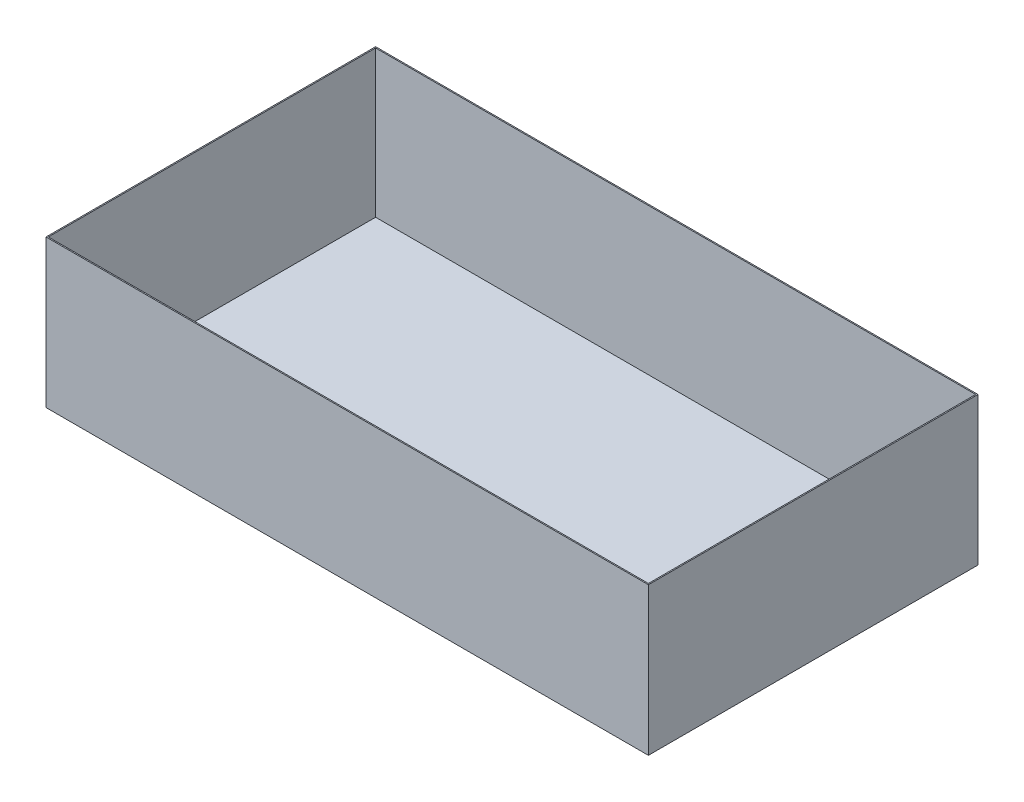
ISO-10303-21;
HEADER;
FILE_DESCRIPTION(('STEP AP214'),'2;1');
FILE_NAME('part.step','',(''),(''),'','','');
FILE_SCHEMA(('AUTOMOTIVE_DESIGN { 1 0 10303 214 1 1 1 1 }'));
ENDSEC;
DATA;
#1=APPLICATION_CONTEXT('core data for automotive mechanical design processes');
#2=APPLICATION_PROTOCOL_DEFINITION('international standard','automotive_design',2000,#1);
#3=PRODUCT_CONTEXT('',#1,'mechanical');
#4=PRODUCT('Part','Part','',(#3));
#5=PRODUCT_RELATED_PRODUCT_CATEGORY('part','',(#4));
#6=PRODUCT_DEFINITION_FORMATION('','',#4);
#7=PRODUCT_DEFINITION_CONTEXT('part definition',#1,'design');
#8=PRODUCT_DEFINITION('design','',#6,#7);
#9=PRODUCT_DEFINITION_SHAPE('','',#8);
#10=(LENGTH_UNIT() NAMED_UNIT(*) SI_UNIT(.MILLI.,.METRE.));
#11=(NAMED_UNIT(*) PLANE_ANGLE_UNIT() SI_UNIT($,.RADIAN.));
#12=(NAMED_UNIT(*) SI_UNIT($,.STERADIAN.) SOLID_ANGLE_UNIT());
#13=UNCERTAINTY_MEASURE_WITH_UNIT(LENGTH_MEASURE(1.E-05),#10,'distance_accuracy_value','');
#14=(GEOMETRIC_REPRESENTATION_CONTEXT(3) GLOBAL_UNCERTAINTY_ASSIGNED_CONTEXT((#13)) GLOBAL_UNIT_ASSIGNED_CONTEXT((#10,
#11,#12)) REPRESENTATION_CONTEXT('',''));
#15=CARTESIAN_POINT('',(0.,0.,0.));
#16=DIRECTION('',(0.,0.,1.));
#17=DIRECTION('',(1.,0.,0.));
#18=AXIS2_PLACEMENT_3D('',#15,#16,#17);
#19=CARTESIAN_POINT('',(-224.976152623211,130.,-90.5802861685215));
#20=DIRECTION('',(1.,0.,0.));
#21=DIRECTION('',(0.,0.,-1.));
#22=AXIS2_PLACEMENT_3D('',#19,#20,#21);
#23=PLANE('',#22);
#24=DIRECTION('',(0.,0.,1.));
#25=VECTOR('',#24,1.);
#26=CARTESIAN_POINT('',(-224.976152623211,0.,-90.5802861685215));
#27=LINE('',#26,#25);
#28=CARTESIAN_POINT('',(-224.976152623211,0.,-90.5802861685215));
#29=VERTEX_POINT('',#28);
#30=CARTESIAN_POINT('',(-224.976152623211,0.,199.419713831479));
#31=VERTEX_POINT('',#30);
#32=EDGE_CURVE('E167',#29,#31,#27,.T.);
#33=ORIENTED_EDGE('',*,*,#32,.T.);
#34=DIRECTION('',(0.,-1.,0.));
#35=VECTOR('',#34,1.);
#36=CARTESIAN_POINT('',(-224.976152623211,130.,199.419713831479));
#37=LINE('',#36,#35);
#38=CARTESIAN_POINT('',(-224.976152623211,130.,199.419713831479));
#39=VERTEX_POINT('',#38);
#40=EDGE_CURVE('E11',#39,#31,#37,.T.);
#41=ORIENTED_EDGE('',*,*,#40,.F.);
#42=DIRECTION('',(0.,0.,1.));
#43=VECTOR('',#42,1.);
#44=CARTESIAN_POINT('',(-224.976152623211,130.,-90.5802861685215));
#45=LINE('',#44,#43);
#46=CARTESIAN_POINT('',(-224.976152623211,130.,-90.5802861685215));
#47=VERTEX_POINT('',#46);
#48=EDGE_CURVE('E156',#47,#39,#45,.T.);
#49=ORIENTED_EDGE('',*,*,#48,.F.);
#50=DIRECTION('',(0.,-1.,0.));
#51=VECTOR('',#50,1.);
#52=CARTESIAN_POINT('',(-224.976152623211,130.,-90.5802861685215));
#53=LINE('',#52,#51);
#54=EDGE_CURVE('E166',#47,#29,#53,.T.);
#55=ORIENTED_EDGE('',*,*,#54,.T.);
#56=EDGE_LOOP('',(#33,#41,#49,#55));
#57=FACE_BOUND('',#56,.T.);
#58=ADVANCED_FACE('F39',(#57),#23,.F.);
#59=CARTESIAN_POINT('',(-224.976152623211,130.,199.419713831479));
#60=DIRECTION('',(0.,0.,-1.));
#61=DIRECTION('',(-1.,0.,0.));
#62=AXIS2_PLACEMENT_3D('',#59,#60,#61);
#63=PLANE('',#62);
#64=DIRECTION('',(1.,0.,0.));
#65=VECTOR('',#64,1.);
#66=CARTESIAN_POINT('',(-224.976152623211,0.,199.419713831479));
#67=LINE('',#66,#65);
#68=CARTESIAN_POINT('',(305.023847376789,0.,199.419713831479));
#69=VERTEX_POINT('',#68);
#70=EDGE_CURVE('E171',#31,#69,#67,.T.);
#71=ORIENTED_EDGE('',*,*,#70,.T.);
#72=DIRECTION('',(0.,-1.,0.));
#73=VECTOR('',#72,1.);
#74=CARTESIAN_POINT('',(305.023847376789,130.,199.419713831479));
#75=LINE('',#74,#73);
#76=CARTESIAN_POINT('',(305.023847376789,130.,199.419713831479));
#77=VERTEX_POINT('',#76);
#78=EDGE_CURVE('E47',#77,#69,#75,.T.);
#79=ORIENTED_EDGE('',*,*,#78,.F.);
#80=DIRECTION('',(1.,0.,0.));
#81=VECTOR('',#80,1.);
#82=CARTESIAN_POINT('',(-224.976152623211,130.,199.419713831479));
#83=LINE('',#82,#81);
#84=EDGE_CURVE('E91',#39,#77,#83,.T.);
#85=ORIENTED_EDGE('',*,*,#84,.F.);
#86=ORIENTED_EDGE('',*,*,#40,.T.);
#87=EDGE_LOOP('',(#71,#79,#85,#86));
#88=FACE_BOUND('',#87,.T.);
#89=ADVANCED_FACE('F206',(#88),#63,.F.);
#90=CARTESIAN_POINT('',(305.023847376789,130.,-90.5802861685215));
#91=DIRECTION('',(-1.,0.,0.));
#92=DIRECTION('',(0.,0.,1.));
#93=AXIS2_PLACEMENT_3D('',#90,#91,#92);
#94=PLANE('',#93);
#95=DIRECTION('',(0.,0.,-1.));
#96=VECTOR('',#95,1.);
#97=CARTESIAN_POINT('',(305.023847376789,0.,-90.5802861685215));
#98=LINE('',#97,#96);
#99=CARTESIAN_POINT('',(305.023847376789,0.,-90.5802861685215));
#100=VERTEX_POINT('',#99);
#101=EDGE_CURVE('E174',#69,#100,#98,.T.);
#102=ORIENTED_EDGE('',*,*,#101,.T.);
#103=DIRECTION('',(0.,-1.,0.));
#104=VECTOR('',#103,1.);
#105=CARTESIAN_POINT('',(305.023847376789,130.,-90.5802861685215));
#106=LINE('',#105,#104);
#107=CARTESIAN_POINT('',(305.023847376789,130.,-90.5802861685215));
#108=VERTEX_POINT('',#107);
#109=EDGE_CURVE('E181',#108,#100,#106,.T.);
#110=ORIENTED_EDGE('',*,*,#109,.F.);
#111=DIRECTION('',(0.,0.,-1.));
#112=VECTOR('',#111,1.);
#113=CARTESIAN_POINT('',(305.023847376789,130.,-90.5802861685215));
#114=LINE('',#113,#112);
#115=EDGE_CURVE('E161',#77,#108,#114,.T.);
#116=ORIENTED_EDGE('',*,*,#115,.F.);
#117=ORIENTED_EDGE('',*,*,#78,.T.);
#118=EDGE_LOOP('',(#102,#110,#116,#117));
#119=FACE_BOUND('',#118,.T.);
#120=ADVANCED_FACE('F188',(#119),#94,.F.);
#121=CARTESIAN_POINT('',(-224.976152623211,130.,-90.5802861685215));
#122=DIRECTION('',(0.,0.,1.));
#123=DIRECTION('',(1.,0.,0.));
#124=AXIS2_PLACEMENT_3D('',#121,#122,#123);
#125=PLANE('',#124);
#126=DIRECTION('',(-1.,0.,0.));
#127=VECTOR('',#126,1.);
#128=CARTESIAN_POINT('',(-224.976152623211,0.,-90.5802861685215));
#129=LINE('',#128,#127);
#130=EDGE_CURVE('E84',#100,#29,#129,.T.);
#131=ORIENTED_EDGE('',*,*,#130,.T.);
#132=ORIENTED_EDGE('',*,*,#54,.F.);
#133=DIRECTION('',(-1.,0.,0.));
#134=VECTOR('',#133,1.);
#135=CARTESIAN_POINT('',(-224.976152623211,130.,-90.5802861685215));
#136=LINE('',#135,#134);
#137=EDGE_CURVE('E63',#108,#47,#136,.T.);
#138=ORIENTED_EDGE('',*,*,#137,.F.);
#139=ORIENTED_EDGE('',*,*,#109,.T.);
#140=EDGE_LOOP('',(#131,#132,#138,#139));
#141=FACE_BOUND('',#140,.T.);
#142=ADVANCED_FACE('F196',(#141),#125,.F.);
#143=CARTESIAN_POINT('',(0.,130.,0.));
#144=DIRECTION('',(0.,1.,0.));
#145=DIRECTION('',(0.,0.,1.));
#146=AXIS2_PLACEMENT_3D('',#143,#144,#145);
#147=PLANE('',#146);
#148=DIRECTION('',(0.,0.,1.));
#149=VECTOR('',#148,1.);
#150=CARTESIAN_POINT('',(-223.976152623211,130.,-90.5802861685215));
#151=LINE('',#150,#149);
#152=CARTESIAN_POINT('',(-223.976152623211,130.,-89.5802861685215));
#153=VERTEX_POINT('',#152);
#154=CARTESIAN_POINT('',(-223.976152623211,130.,198.419713831479));
#155=VERTEX_POINT('',#154);
#156=EDGE_CURVE('E140',#153,#155,#151,.T.);
#157=ORIENTED_EDGE('',*,*,#156,.F.);
#158=DIRECTION('',(-1.,0.,0.));
#159=VECTOR('',#158,1.);
#160=CARTESIAN_POINT('',(-224.976152623211,130.,-89.5802861685215));
#161=LINE('',#160,#159);
#162=CARTESIAN_POINT('',(304.023847376789,130.,-89.5802861685215));
#163=VERTEX_POINT('',#162);
#164=EDGE_CURVE('E153',#163,#153,#161,.T.);
#165=ORIENTED_EDGE('',*,*,#164,.F.);
#166=DIRECTION('',(0.,0.,-1.));
#167=VECTOR('',#166,1.);
#168=CARTESIAN_POINT('',(304.023847376789,130.,-90.5802861685215));
#169=LINE('',#168,#167);
#170=CARTESIAN_POINT('',(304.023847376789,130.,198.419713831479));
#171=VERTEX_POINT('',#170);
#172=EDGE_CURVE('E150',#171,#163,#169,.T.);
#173=ORIENTED_EDGE('',*,*,#172,.F.);
#174=DIRECTION('',(1.,0.,0.));
#175=VECTOR('',#174,1.);
#176=CARTESIAN_POINT('',(-224.976152623211,130.,198.419713831479));
#177=LINE('',#176,#175);
#178=EDGE_CURVE('E129',#155,#171,#177,.T.);
#179=ORIENTED_EDGE('',*,*,#178,.F.);
#180=EDGE_LOOP('',(#157,#165,#173,#179));
#181=FACE_BOUND('',#180,.T.);
#182=ORIENTED_EDGE('',*,*,#48,.T.);
#183=ORIENTED_EDGE('',*,*,#84,.T.);
#184=ORIENTED_EDGE('',*,*,#115,.T.);
#185=ORIENTED_EDGE('',*,*,#137,.T.);
#186=EDGE_LOOP('',(#182,#183,#184,#185));
#187=FACE_BOUND('',#186,.T.);
#188=ADVANCED_FACE('F198',(#181,#187),#147,.T.);
#189=CARTESIAN_POINT('',(0.,0.,0.));
#190=DIRECTION('',(0.,1.,0.));
#191=DIRECTION('',(0.,0.,1.));
#192=AXIS2_PLACEMENT_3D('',#189,#190,#191);
#193=PLANE('',#192);
#194=ORIENTED_EDGE('',*,*,#32,.F.);
#195=ORIENTED_EDGE('',*,*,#130,.F.);
#196=ORIENTED_EDGE('',*,*,#101,.F.);
#197=ORIENTED_EDGE('',*,*,#70,.F.);
#198=EDGE_LOOP('',(#194,#195,#196,#197));
#199=FACE_BOUND('',#198,.T.);
#200=ADVANCED_FACE('F192',(#199),#193,.F.);
#201=CARTESIAN_POINT('',(-223.976152623211,130.,-90.5802861685215));
#202=DIRECTION('',(1.,0.,0.));
#203=DIRECTION('',(0.,0.,-1.));
#204=AXIS2_PLACEMENT_3D('',#201,#202,#203);
#205=PLANE('',#204);
#206=DIRECTION('',(0.,0.,1.));
#207=VECTOR('',#206,1.);
#208=CARTESIAN_POINT('',(-223.976152623211,1.,-90.5802861685215));
#209=LINE('',#208,#207);
#210=CARTESIAN_POINT('',(-223.976152623211,1.,-89.5802861685215));
#211=VERTEX_POINT('',#210);
#212=CARTESIAN_POINT('',(-223.976152623211,1.,198.419713831479));
#213=VERTEX_POINT('',#212);
#214=EDGE_CURVE('E119',#211,#213,#209,.T.);
#215=ORIENTED_EDGE('',*,*,#214,.F.);
#216=DIRECTION('',(0.,-1.,0.));
#217=VECTOR('',#216,1.);
#218=CARTESIAN_POINT('',(-223.976152623211,130.,-89.5802861685215));
#219=LINE('',#218,#217);
#220=EDGE_CURVE('E144',#153,#211,#219,.T.);
#221=ORIENTED_EDGE('',*,*,#220,.F.);
#222=ORIENTED_EDGE('',*,*,#156,.T.);
#223=DIRECTION('',(0.,-1.,0.));
#224=VECTOR('',#223,1.);
#225=CARTESIAN_POINT('',(-223.976152623211,130.,198.419713831479));
#226=LINE('',#225,#224);
#227=EDGE_CURVE('E133',#155,#213,#226,.T.);
#228=ORIENTED_EDGE('',*,*,#227,.T.);
#229=EDGE_LOOP('',(#215,#221,#222,#228));
#230=FACE_BOUND('',#229,.T.);
#231=ADVANCED_FACE('F233',(#230),#205,.T.);
#232=CARTESIAN_POINT('',(-224.976152623211,130.,198.419713831479));
#233=DIRECTION('',(0.,0.,-1.));
#234=DIRECTION('',(-1.,0.,0.));
#235=AXIS2_PLACEMENT_3D('',#232,#233,#234);
#236=PLANE('',#235);
#237=DIRECTION('',(1.,0.,0.));
#238=VECTOR('',#237,1.);
#239=CARTESIAN_POINT('',(-224.976152623211,1.,198.419713831479));
#240=LINE('',#239,#238);
#241=CARTESIAN_POINT('',(304.023847376789,1.,198.419713831479));
#242=VERTEX_POINT('',#241);
#243=EDGE_CURVE('E113',#213,#242,#240,.T.);
#244=ORIENTED_EDGE('',*,*,#243,.F.);
#245=ORIENTED_EDGE('',*,*,#227,.F.);
#246=ORIENTED_EDGE('',*,*,#178,.T.);
#247=DIRECTION('',(0.,-1.,0.));
#248=VECTOR('',#247,1.);
#249=CARTESIAN_POINT('',(304.023847376789,130.,198.419713831479));
#250=LINE('',#249,#248);
#251=EDGE_CURVE('E126',#171,#242,#250,.T.);
#252=ORIENTED_EDGE('',*,*,#251,.T.);
#253=EDGE_LOOP('',(#244,#245,#246,#252));
#254=FACE_BOUND('',#253,.T.);
#255=ADVANCED_FACE('F127',(#254),#236,.T.);
#256=CARTESIAN_POINT('',(304.023847376789,130.,-90.5802861685215));
#257=DIRECTION('',(-1.,0.,0.));
#258=DIRECTION('',(0.,0.,1.));
#259=AXIS2_PLACEMENT_3D('',#256,#257,#258);
#260=PLANE('',#259);
#261=DIRECTION('',(0.,0.,-1.));
#262=VECTOR('',#261,1.);
#263=CARTESIAN_POINT('',(304.023847376789,1.,-90.5802861685215));
#264=LINE('',#263,#262);
#265=CARTESIAN_POINT('',(304.023847376789,1.,-89.5802861685215));
#266=VERTEX_POINT('',#265);
#267=EDGE_CURVE('E117',#242,#266,#264,.T.);
#268=ORIENTED_EDGE('',*,*,#267,.F.);
#269=ORIENTED_EDGE('',*,*,#251,.F.);
#270=ORIENTED_EDGE('',*,*,#172,.T.);
#271=DIRECTION('',(0.,-1.,0.));
#272=VECTOR('',#271,1.);
#273=CARTESIAN_POINT('',(304.023847376789,130.,-89.5802861685215));
#274=LINE('',#273,#272);
#275=EDGE_CURVE('E54',#163,#266,#274,.T.);
#276=ORIENTED_EDGE('',*,*,#275,.T.);
#277=EDGE_LOOP('',(#268,#269,#270,#276));
#278=FACE_BOUND('',#277,.T.);
#279=ADVANCED_FACE('F135',(#278),#260,.T.);
#280=CARTESIAN_POINT('',(-224.976152623211,130.,-89.5802861685215));
#281=DIRECTION('',(0.,0.,1.));
#282=DIRECTION('',(1.,0.,0.));
#283=AXIS2_PLACEMENT_3D('',#280,#281,#282);
#284=PLANE('',#283);
#285=DIRECTION('',(-1.,0.,0.));
#286=VECTOR('',#285,1.);
#287=CARTESIAN_POINT('',(-224.976152623211,1.,-89.5802861685215));
#288=LINE('',#287,#286);
#289=EDGE_CURVE('E137',#266,#211,#288,.T.);
#290=ORIENTED_EDGE('',*,*,#289,.F.);
#291=ORIENTED_EDGE('',*,*,#275,.F.);
#292=ORIENTED_EDGE('',*,*,#164,.T.);
#293=ORIENTED_EDGE('',*,*,#220,.T.);
#294=EDGE_LOOP('',(#290,#291,#292,#293));
#295=FACE_BOUND('',#294,.T.);
#296=ADVANCED_FACE('F263',(#295),#284,.T.);
#297=CARTESIAN_POINT('',(0.,1.,0.));
#298=DIRECTION('',(0.,1.,0.));
#299=DIRECTION('',(0.,0.,1.));
#300=AXIS2_PLACEMENT_3D('',#297,#298,#299);
#301=PLANE('',#300);
#302=ORIENTED_EDGE('',*,*,#214,.T.);
#303=ORIENTED_EDGE('',*,*,#243,.T.);
#304=ORIENTED_EDGE('',*,*,#267,.T.);
#305=ORIENTED_EDGE('',*,*,#289,.T.);
#306=EDGE_LOOP('',(#302,#303,#304,#305));
#307=FACE_BOUND('',#306,.T.);
#308=ADVANCED_FACE('F115',(#307),#301,.T.);
#309=CLOSED_SHELL('',(#58,#89,#120,#142,#188,#200,#231,#255,#279,#296,#308));
#310=MANIFOLD_SOLID_BREP('B2',#309);
#311=ADVANCED_BREP_SHAPE_REPRESENTATION('',(#18,#310),#14);
#312=SHAPE_DEFINITION_REPRESENTATION(#9,#311);
ENDSEC;
END-ISO-10303-21;
